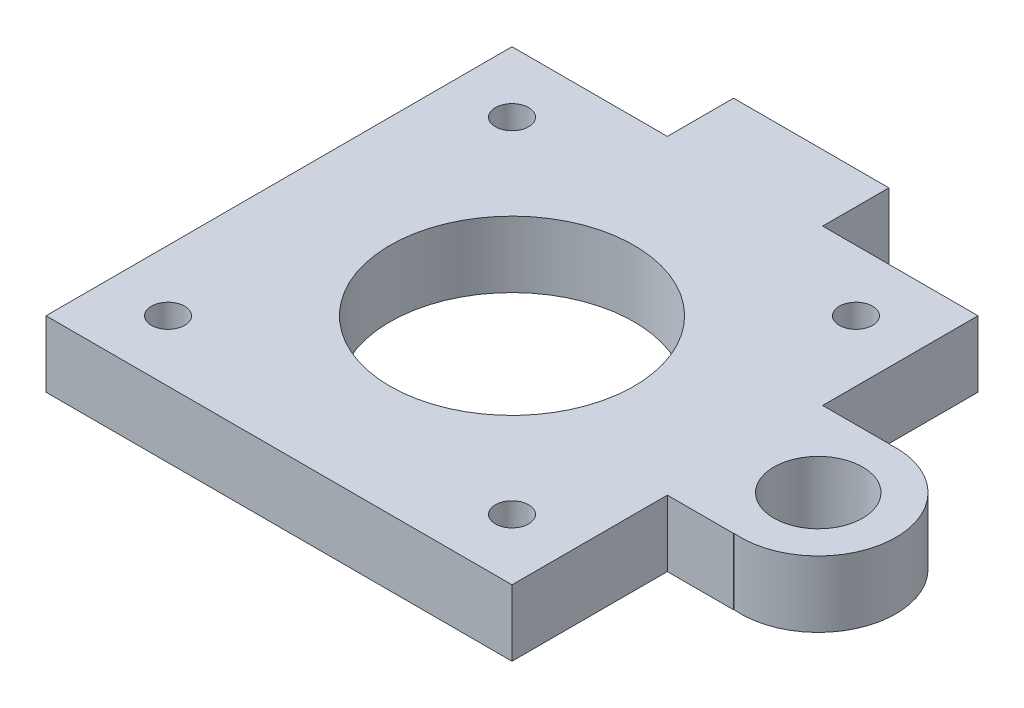
ISO-10303-21;
HEADER;
FILE_DESCRIPTION(('STEP AP214'),'2;1');
FILE_NAME('part.step','',(''),(''),'','','');
FILE_SCHEMA(('AUTOMOTIVE_DESIGN { 1 0 10303 214 1 1 1 1 }'));
ENDSEC;
DATA;
#1=APPLICATION_CONTEXT('core data for automotive mechanical design processes');
#2=APPLICATION_PROTOCOL_DEFINITION('international standard','automotive_design',2000,#1);
#3=PRODUCT_CONTEXT('',#1,'mechanical');
#4=PRODUCT('Part','Part','',(#3));
#5=PRODUCT_RELATED_PRODUCT_CATEGORY('part','',(#4));
#6=PRODUCT_DEFINITION_FORMATION('','',#4);
#7=PRODUCT_DEFINITION_CONTEXT('part definition',#1,'design');
#8=PRODUCT_DEFINITION('design','',#6,#7);
#9=PRODUCT_DEFINITION_SHAPE('','',#8);
#10=(LENGTH_UNIT() NAMED_UNIT(*) SI_UNIT(.MILLI.,.METRE.));
#11=(NAMED_UNIT(*) PLANE_ANGLE_UNIT() SI_UNIT($,.RADIAN.));
#12=(NAMED_UNIT(*) SI_UNIT($,.STERADIAN.) SOLID_ANGLE_UNIT());
#13=UNCERTAINTY_MEASURE_WITH_UNIT(LENGTH_MEASURE(1.E-05),#10,'distance_accuracy_value','');
#14=(GEOMETRIC_REPRESENTATION_CONTEXT(3) GLOBAL_UNCERTAINTY_ASSIGNED_CONTEXT((#13)) GLOBAL_UNIT_ASSIGNED_CONTEXT((#10,
#11,#12)) REPRESENTATION_CONTEXT('',''));
#15=CARTESIAN_POINT('',(0.,0.,0.));
#16=DIRECTION('',(0.,0.,1.));
#17=DIRECTION('',(1.,0.,0.));
#18=AXIS2_PLACEMENT_3D('',#15,#16,#17);
#19=CARTESIAN_POINT('',(47.969,0.,-28.));
#20=DIRECTION('',(1.,0.,0.));
#21=DIRECTION('',(0.,0.,-1.));
#22=AXIS2_PLACEMENT_3D('',#19,#20,#21);
#23=PLANE('',#22);
#24=DIRECTION('',(0.,1.,0.));
#25=VECTOR('',#24,1.);
#26=CARTESIAN_POINT('',(47.969,0.,-27.971147824426));
#27=LINE('',#26,#25);
#28=CARTESIAN_POINT('',(47.969,0.,-27.971147824426));
#29=VERTEX_POINT('',#28);
#30=CARTESIAN_POINT('',(47.969,5.969,-27.971147824426));
#31=VERTEX_POINT('',#30);
#32=EDGE_CURVE('E11',#29,#31,#27,.T.);
#33=ORIENTED_EDGE('',*,*,#32,.F.);
#34=DIRECTION('',(0.,0.,-1.));
#35=VECTOR('',#34,1.);
#36=CARTESIAN_POINT('',(47.969,0.,-28.));
#37=LINE('',#36,#35);
#38=CARTESIAN_POINT('',(47.969,0.,-28.));
#39=VERTEX_POINT('',#38);
#40=EDGE_CURVE('E307',#29,#39,#37,.T.);
#41=ORIENTED_EDGE('',*,*,#40,.T.);
#42=DIRECTION('',(0.,1.,0.));
#43=VECTOR('',#42,1.);
#44=CARTESIAN_POINT('',(47.969,0.,-28.));
#45=LINE('',#44,#43);
#46=CARTESIAN_POINT('',(47.969,5.969,-28.));
#47=VERTEX_POINT('',#46);
#48=EDGE_CURVE('E164',#39,#47,#45,.T.);
#49=ORIENTED_EDGE('',*,*,#48,.T.);
#50=DIRECTION('',(0.,0.,-1.));
#51=VECTOR('',#50,1.);
#52=CARTESIAN_POINT('',(47.969,5.969,-28.));
#53=LINE('',#52,#51);
#54=EDGE_CURVE('E153',#31,#47,#53,.T.);
#55=ORIENTED_EDGE('',*,*,#54,.F.);
#56=EDGE_LOOP('',(#33,#41,#49,#55));
#57=FACE_BOUND('',#56,.T.);
#58=ADVANCED_FACE('F34',(#57),#23,.T.);
#59=CARTESIAN_POINT('',(42.,5.969,0.));
#60=DIRECTION('',(-1.,0.,0.));
#61=DIRECTION('',(0.,0.,1.));
#62=AXIS2_PLACEMENT_3D('',#59,#60,#61);
#63=PLANE('',#62);
#64=DIRECTION('',(0.,1.,0.));
#65=VECTOR('',#64,1.);
#66=CARTESIAN_POINT('',(42.,0.,-28.));
#67=LINE('',#66,#65);
#68=CARTESIAN_POINT('',(42.,0.,-28.));
#69=VERTEX_POINT('',#68);
#70=CARTESIAN_POINT('',(42.,5.969,-28.));
#71=VERTEX_POINT('',#70);
#72=EDGE_CURVE('E161',#69,#71,#67,.T.);
#73=ORIENTED_EDGE('',*,*,#72,.F.);
#74=DIRECTION('',(0.,0.,-1.));
#75=VECTOR('',#74,1.);
#76=CARTESIAN_POINT('',(42.,0.,0.));
#77=LINE('',#76,#75);
#78=CARTESIAN_POINT('',(42.,0.,-42.));
#79=VERTEX_POINT('',#78);
#80=EDGE_CURVE('E246',#69,#79,#77,.T.);
#81=ORIENTED_EDGE('',*,*,#80,.T.);
#82=DIRECTION('',(0.,-1.,0.));
#83=VECTOR('',#82,1.);
#84=CARTESIAN_POINT('',(42.,5.969,-42.));
#85=LINE('',#84,#83);
#86=CARTESIAN_POINT('',(42.,5.969,-42.));
#87=VERTEX_POINT('',#86);
#88=EDGE_CURVE('E255',#87,#79,#85,.T.);
#89=ORIENTED_EDGE('',*,*,#88,.F.);
#90=DIRECTION('',(0.,0.,-1.));
#91=VECTOR('',#90,1.);
#92=CARTESIAN_POINT('',(42.,5.969,0.));
#93=LINE('',#92,#91);
#94=EDGE_CURVE('E234',#71,#87,#93,.T.);
#95=ORIENTED_EDGE('',*,*,#94,.F.);
#96=EDGE_LOOP('',(#73,#81,#89,#95));
#97=FACE_BOUND('',#96,.T.);
#98=ADVANCED_FACE('F304',(#97),#63,.F.);
#99=CARTESIAN_POINT('',(0.,5.969,-42.));
#100=DIRECTION('',(0.,0.,1.));
#101=DIRECTION('',(1.,0.,0.));
#102=AXIS2_PLACEMENT_3D('',#99,#100,#101);
#103=PLANE('',#102);
#104=DIRECTION('',(0.,1.,0.));
#105=VECTOR('',#104,1.);
#106=CARTESIAN_POINT('',(14.,0.,-42.));
#107=LINE('',#106,#105);
#108=CARTESIAN_POINT('',(14.,0.,-42.));
#109=VERTEX_POINT('',#108);
#110=CARTESIAN_POINT('',(14.,5.969,-42.));
#111=VERTEX_POINT('',#110);
#112=EDGE_CURVE('E189',#109,#111,#107,.T.);
#113=ORIENTED_EDGE('',*,*,#112,.F.);
#114=DIRECTION('',(-1.,0.,0.));
#115=VECTOR('',#114,1.);
#116=CARTESIAN_POINT('',(0.,0.,-42.));
#117=LINE('',#116,#115);
#118=CARTESIAN_POINT('',(0.,0.,-42.));
#119=VERTEX_POINT('',#118);
#120=EDGE_CURVE('E250',#109,#119,#117,.T.);
#121=ORIENTED_EDGE('',*,*,#120,.T.);
#122=DIRECTION('',(0.,-1.,0.));
#123=VECTOR('',#122,1.);
#124=CARTESIAN_POINT('',(0.,5.969,-42.));
#125=LINE('',#124,#123);
#126=CARTESIAN_POINT('',(0.,5.969,-42.));
#127=VERTEX_POINT('',#126);
#128=EDGE_CURVE('E241',#127,#119,#125,.T.);
#129=ORIENTED_EDGE('',*,*,#128,.F.);
#130=DIRECTION('',(-1.,0.,0.));
#131=VECTOR('',#130,1.);
#132=CARTESIAN_POINT('',(0.,5.969,-42.));
#133=LINE('',#132,#131);
#134=EDGE_CURVE('E237',#111,#127,#133,.T.);
#135=ORIENTED_EDGE('',*,*,#134,.F.);
#136=EDGE_LOOP('',(#113,#121,#129,#135));
#137=FACE_BOUND('',#136,.T.);
#138=ADVANCED_FACE('F286',(#137),#103,.F.);
#139=CARTESIAN_POINT('',(0.,5.969,0.));
#140=DIRECTION('',(0.,-1.,0.));
#141=DIRECTION('',(0.,0.,-1.));
#142=AXIS2_PLACEMENT_3D('',#139,#140,#141);
#143=PLANE('',#142);
#144=CARTESIAN_POINT('',(48.6039,5.969,-21.));
#145=DIRECTION('',(0.,1.,0.));
#146=DIRECTION('',(0.,0.,1.));
#147=AXIS2_PLACEMENT_3D('',#144,#145,#146);
#148=CIRCLE('',#147,4.00000000000001);
#149=CARTESIAN_POINT('',(48.6039,5.969,-17.));
#150=VERTEX_POINT('',#149);
#151=EDGE_CURVE('E314',#150,#150,#148,.T.);
#152=ORIENTED_EDGE('',*,*,#151,.F.);
#153=EDGE_LOOP('',(#152));
#154=FACE_BOUND('',#153,.T.);
#155=CARTESIAN_POINT('',(47.969,5.969,-14.));
#156=VERTEX_POINT('',#155);
#157=CARTESIAN_POINT('',(47.969,5.969,-14.028852175574));
#158=VERTEX_POINT('',#157);
#159=EDGE_CURVE('E144',#156,#158,#53,.T.);
#160=ORIENTED_EDGE('',*,*,#159,.T.);
#161=CARTESIAN_POINT('',(48.6039,5.969,-21.));
#162=DIRECTION('',(0.,1.,0.));
#163=DIRECTION('',(0.,0.,1.));
#164=AXIS2_PLACEMENT_3D('',#161,#162,#163);
#165=CIRCLE('',#164,7.);
#166=EDGE_CURVE('E50',#158,#31,#165,.T.);
#167=ORIENTED_EDGE('',*,*,#166,.T.);
#168=ORIENTED_EDGE('',*,*,#54,.T.);
#169=DIRECTION('',(-1.,0.,0.));
#170=VECTOR('',#169,1.);
#171=CARTESIAN_POINT('',(42.,5.969,-28.));
#172=LINE('',#171,#170);
#173=EDGE_CURVE('E152',#47,#71,#172,.T.);
#174=ORIENTED_EDGE('',*,*,#173,.T.);
#175=ORIENTED_EDGE('',*,*,#94,.T.);
#176=CARTESIAN_POINT('',(28.,5.969,-42.));
#177=VERTEX_POINT('',#176);
#178=EDGE_CURVE('E238',#87,#177,#133,.T.);
#179=ORIENTED_EDGE('',*,*,#178,.T.);
#180=DIRECTION('',(0.,0.,-1.));
#181=VECTOR('',#180,1.);
#182=CARTESIAN_POINT('',(28.,5.969,-47.969));
#183=LINE('',#182,#181);
#184=CARTESIAN_POINT('',(28.,5.969,-47.969));
#185=VERTEX_POINT('',#184);
#186=EDGE_CURVE('E163',#177,#185,#183,.T.);
#187=ORIENTED_EDGE('',*,*,#186,.T.);
#188=DIRECTION('',(-1.,0.,0.));
#189=VECTOR('',#188,1.);
#190=CARTESIAN_POINT('',(14.,5.969,-47.969));
#191=LINE('',#190,#189);
#192=CARTESIAN_POINT('',(14.,5.969,-47.969));
#193=VERTEX_POINT('',#192);
#194=EDGE_CURVE('E184',#185,#193,#191,.T.);
#195=ORIENTED_EDGE('',*,*,#194,.T.);
#196=DIRECTION('',(0.,0.,1.));
#197=VECTOR('',#196,1.);
#198=CARTESIAN_POINT('',(14.,5.969,-42.));
#199=LINE('',#198,#197);
#200=EDGE_CURVE('E176',#193,#111,#199,.T.);
#201=ORIENTED_EDGE('',*,*,#200,.T.);
#202=ORIENTED_EDGE('',*,*,#134,.T.);
#203=DIRECTION('',(0.,0.,1.));
#204=VECTOR('',#203,1.);
#205=CARTESIAN_POINT('',(0.,5.969,0.));
#206=LINE('',#205,#204);
#207=CARTESIAN_POINT('',(0.,5.969,0.));
#208=VERTEX_POINT('',#207);
#209=EDGE_CURVE('E228',#127,#208,#206,.T.);
#210=ORIENTED_EDGE('',*,*,#209,.T.);
#211=DIRECTION('',(1.,0.,0.));
#212=VECTOR('',#211,1.);
#213=CARTESIAN_POINT('',(0.,5.969,0.));
#214=LINE('',#213,#212);
#215=CARTESIAN_POINT('',(42.,5.969,0.));
#216=VERTEX_POINT('',#215);
#217=EDGE_CURVE('E231',#208,#216,#214,.T.);
#218=ORIENTED_EDGE('',*,*,#217,.T.);
#219=CARTESIAN_POINT('',(42.,5.969,-14.));
#220=VERTEX_POINT('',#219);
#221=EDGE_CURVE('E235',#216,#220,#93,.T.);
#222=ORIENTED_EDGE('',*,*,#221,.T.);
#223=DIRECTION('',(1.,0.,0.));
#224=VECTOR('',#223,1.);
#225=CARTESIAN_POINT('',(42.,5.969,-14.));
#226=LINE('',#225,#224);
#227=EDGE_CURVE('E57',#220,#156,#226,.T.);
#228=ORIENTED_EDGE('',*,*,#227,.T.);
#229=EDGE_LOOP('',(#160,#167,#168,#174,#175,#179,#187,#195,#201,#202,#210,#218,#222,#228));
#230=FACE_BOUND('',#229,.T.);
#231=CARTESIAN_POINT('',(21.,5.969,-21.));
#232=DIRECTION('',(0.,1.,0.));
#233=DIRECTION('',(0.,0.,1.));
#234=AXIS2_PLACEMENT_3D('',#231,#232,#233);
#235=CIRCLE('',#234,11.);
#236=CARTESIAN_POINT('',(21.,5.969,-9.99999999999999));
#237=VERTEX_POINT('',#236);
#238=EDGE_CURVE('E222',#237,#237,#235,.T.);
#239=ORIENTED_EDGE('',*,*,#238,.F.);
#240=EDGE_LOOP('',(#239));
#241=FACE_BOUND('',#240,.T.);
#242=CARTESIAN_POINT('',(5.5,5.969,-36.5));
#243=DIRECTION('',(0.,1.,0.));
#244=DIRECTION('',(0.,0.,1.));
#245=AXIS2_PLACEMENT_3D('',#242,#243,#244);
#246=CIRCLE('',#245,1.5);
#247=CARTESIAN_POINT('',(5.5,5.969,-35.));
#248=VERTEX_POINT('',#247);
#249=EDGE_CURVE('E216',#248,#248,#246,.T.);
#250=ORIENTED_EDGE('',*,*,#249,.F.);
#251=EDGE_LOOP('',(#250));
#252=FACE_BOUND('',#251,.T.);
#253=CARTESIAN_POINT('',(36.5,5.969,-36.5));
#254=DIRECTION('',(0.,1.,0.));
#255=DIRECTION('',(0.,0.,1.));
#256=AXIS2_PLACEMENT_3D('',#253,#254,#255);
#257=CIRCLE('',#256,1.5);
#258=CARTESIAN_POINT('',(36.5,5.969,-35.));
#259=VERTEX_POINT('',#258);
#260=EDGE_CURVE('E210',#259,#259,#257,.T.);
#261=ORIENTED_EDGE('',*,*,#260,.F.);
#262=EDGE_LOOP('',(#261));
#263=FACE_BOUND('',#262,.T.);
#264=CARTESIAN_POINT('',(36.5,5.969,-5.5));
#265=DIRECTION('',(0.,1.,0.));
#266=DIRECTION('',(0.,0.,1.));
#267=AXIS2_PLACEMENT_3D('',#264,#265,#266);
#268=CIRCLE('',#267,1.5);
#269=CARTESIAN_POINT('',(36.5,5.969,-4.));
#270=VERTEX_POINT('',#269);
#271=EDGE_CURVE('E204',#270,#270,#268,.T.);
#272=ORIENTED_EDGE('',*,*,#271,.F.);
#273=EDGE_LOOP('',(#272));
#274=FACE_BOUND('',#273,.T.);
#275=CARTESIAN_POINT('',(5.5,5.969,-5.5));
#276=DIRECTION('',(0.,1.,0.));
#277=DIRECTION('',(0.,0.,1.));
#278=AXIS2_PLACEMENT_3D('',#275,#276,#277);
#279=CIRCLE('',#278,1.5);
#280=CARTESIAN_POINT('',(5.5,5.969,-4.));
#281=VERTEX_POINT('',#280);
#282=EDGE_CURVE('E198',#281,#281,#279,.T.);
#283=ORIENTED_EDGE('',*,*,#282,.F.);
#284=EDGE_LOOP('',(#283));
#285=FACE_BOUND('',#284,.T.);
#286=ADVANCED_FACE('F149',(#154,#230,#241,#252,#263,#274,#285),#143,.F.);
#287=CARTESIAN_POINT('',(0.,0.,0.));
#288=DIRECTION('',(0.,-1.,0.));
#289=DIRECTION('',(0.,0.,-1.));
#290=AXIS2_PLACEMENT_3D('',#287,#288,#289);
#291=PLANE('',#290);
#292=CARTESIAN_POINT('',(48.6039,0.,-21.));
#293=DIRECTION('',(0.,-1.,0.));
#294=DIRECTION('',(0.,0.,-1.));
#295=AXIS2_PLACEMENT_3D('',#292,#293,#294);
#296=CIRCLE('',#295,4.00000000000001);
#297=CARTESIAN_POINT('',(48.6039,0.,-25.));
#298=VERTEX_POINT('',#297);
#299=EDGE_CURVE('E38',#298,#298,#296,.T.);
#300=ORIENTED_EDGE('',*,*,#299,.F.);
#301=EDGE_LOOP('',(#300));
#302=FACE_BOUND('',#301,.T.);
#303=ORIENTED_EDGE('',*,*,#40,.F.);
#304=CARTESIAN_POINT('',(48.6039,0.,-21.));
#305=DIRECTION('',(0.,1.,0.));
#306=DIRECTION('',(0.,0.,1.));
#307=AXIS2_PLACEMENT_3D('',#304,#305,#306);
#308=CIRCLE('',#307,7.);
#309=CARTESIAN_POINT('',(47.969,0.,-14.028852175574));
#310=VERTEX_POINT('',#309);
#311=EDGE_CURVE('E138',#310,#29,#308,.T.);
#312=ORIENTED_EDGE('',*,*,#311,.F.);
#313=CARTESIAN_POINT('',(47.969,0.,-14.));
#314=VERTEX_POINT('',#313);
#315=EDGE_CURVE('E146',#314,#310,#37,.T.);
#316=ORIENTED_EDGE('',*,*,#315,.F.);
#317=DIRECTION('',(1.,0.,0.));
#318=VECTOR('',#317,1.);
#319=CARTESIAN_POINT('',(42.,0.,-14.));
#320=LINE('',#319,#318);
#321=CARTESIAN_POINT('',(42.,0.,-14.));
#322=VERTEX_POINT('',#321);
#323=EDGE_CURVE('E156',#322,#314,#320,.T.);
#324=ORIENTED_EDGE('',*,*,#323,.F.);
#325=CARTESIAN_POINT('',(42.,0.,0.));
#326=VERTEX_POINT('',#325);
#327=EDGE_CURVE('E247',#326,#322,#77,.T.);
#328=ORIENTED_EDGE('',*,*,#327,.F.);
#329=DIRECTION('',(1.,0.,0.));
#330=VECTOR('',#329,1.);
#331=CARTESIAN_POINT('',(0.,0.,0.));
#332=LINE('',#331,#330);
#333=CARTESIAN_POINT('',(0.,0.,0.));
#334=VERTEX_POINT('',#333);
#335=EDGE_CURVE('E244',#334,#326,#332,.T.);
#336=ORIENTED_EDGE('',*,*,#335,.F.);
#337=DIRECTION('',(0.,0.,1.));
#338=VECTOR('',#337,1.);
#339=CARTESIAN_POINT('',(0.,0.,0.));
#340=LINE('',#339,#338);
#341=EDGE_CURVE('E225',#119,#334,#340,.T.);
#342=ORIENTED_EDGE('',*,*,#341,.F.);
#343=ORIENTED_EDGE('',*,*,#120,.F.);
#344=DIRECTION('',(0.,0.,1.));
#345=VECTOR('',#344,1.);
#346=CARTESIAN_POINT('',(14.,0.,-42.));
#347=LINE('',#346,#345);
#348=CARTESIAN_POINT('',(14.,0.,-47.969));
#349=VERTEX_POINT('',#348);
#350=EDGE_CURVE('E179',#349,#109,#347,.T.);
#351=ORIENTED_EDGE('',*,*,#350,.F.);
#352=DIRECTION('',(-1.,0.,0.));
#353=VECTOR('',#352,1.);
#354=CARTESIAN_POINT('',(14.,0.,-47.969));
#355=LINE('',#354,#353);
#356=CARTESIAN_POINT('',(28.,0.,-47.969));
#357=VERTEX_POINT('',#356);
#358=EDGE_CURVE('E175',#357,#349,#355,.T.);
#359=ORIENTED_EDGE('',*,*,#358,.F.);
#360=DIRECTION('',(0.,0.,-1.));
#361=VECTOR('',#360,1.);
#362=CARTESIAN_POINT('',(28.,0.,-47.969));
#363=LINE('',#362,#361);
#364=CARTESIAN_POINT('',(28.,0.,-42.));
#365=VERTEX_POINT('',#364);
#366=EDGE_CURVE('E172',#365,#357,#363,.T.);
#367=ORIENTED_EDGE('',*,*,#366,.F.);
#368=EDGE_CURVE('E232',#79,#365,#117,.T.);
#369=ORIENTED_EDGE('',*,*,#368,.F.);
#370=ORIENTED_EDGE('',*,*,#80,.F.);
#371=DIRECTION('',(-1.,0.,0.));
#372=VECTOR('',#371,1.);
#373=CARTESIAN_POINT('',(42.,0.,-28.));
#374=LINE('',#373,#372);
#375=EDGE_CURVE('E171',#39,#69,#374,.T.);
#376=ORIENTED_EDGE('',*,*,#375,.F.);
#377=EDGE_LOOP('',(#303,#312,#316,#324,#328,#336,#342,#343,#351,#359,#367,#369,#370,#376));
#378=FACE_BOUND('',#377,.T.);
#379=CARTESIAN_POINT('',(36.5,0.,-5.5));
#380=DIRECTION('',(0.,1.,0.));
#381=DIRECTION('',(0.,0.,1.));
#382=AXIS2_PLACEMENT_3D('',#379,#380,#381);
#383=CIRCLE('',#382,1.5);
#384=CARTESIAN_POINT('',(36.5,0.,-4.));
#385=VERTEX_POINT('',#384);
#386=EDGE_CURVE('E201',#385,#385,#383,.T.);
#387=ORIENTED_EDGE('',*,*,#386,.T.);
#388=EDGE_LOOP('',(#387));
#389=FACE_BOUND('',#388,.T.);
#390=CARTESIAN_POINT('',(5.5,0.,-36.5));
#391=DIRECTION('',(0.,1.,0.));
#392=DIRECTION('',(0.,0.,1.));
#393=AXIS2_PLACEMENT_3D('',#390,#391,#392);
#394=CIRCLE('',#393,1.5);
#395=CARTESIAN_POINT('',(5.5,0.,-35.));
#396=VERTEX_POINT('',#395);
#397=EDGE_CURVE('E213',#396,#396,#394,.T.);
#398=ORIENTED_EDGE('',*,*,#397,.T.);
#399=EDGE_LOOP('',(#398));
#400=FACE_BOUND('',#399,.T.);
#401=CARTESIAN_POINT('',(21.,0.,-21.));
#402=DIRECTION('',(0.,1.,0.));
#403=DIRECTION('',(0.,0.,1.));
#404=AXIS2_PLACEMENT_3D('',#401,#402,#403);
#405=CIRCLE('',#404,11.);
#406=CARTESIAN_POINT('',(21.,0.,-9.99999999999999));
#407=VERTEX_POINT('',#406);
#408=EDGE_CURVE('E219',#407,#407,#405,.T.);
#409=ORIENTED_EDGE('',*,*,#408,.T.);
#410=EDGE_LOOP('',(#409));
#411=FACE_BOUND('',#410,.T.);
#412=CARTESIAN_POINT('',(36.5,0.,-36.5));
#413=DIRECTION('',(0.,1.,0.));
#414=DIRECTION('',(0.,0.,1.));
#415=AXIS2_PLACEMENT_3D('',#412,#413,#414);
#416=CIRCLE('',#415,1.5);
#417=CARTESIAN_POINT('',(36.5,0.,-35.));
#418=VERTEX_POINT('',#417);
#419=EDGE_CURVE('E207',#418,#418,#416,.T.);
#420=ORIENTED_EDGE('',*,*,#419,.T.);
#421=EDGE_LOOP('',(#420));
#422=FACE_BOUND('',#421,.T.);
#423=CARTESIAN_POINT('',(5.5,0.,-5.5));
#424=DIRECTION('',(0.,1.,0.));
#425=DIRECTION('',(0.,0.,1.));
#426=AXIS2_PLACEMENT_3D('',#423,#424,#425);
#427=CIRCLE('',#426,1.5);
#428=CARTESIAN_POINT('',(5.5,0.,-4.));
#429=VERTEX_POINT('',#428);
#430=EDGE_CURVE('E191',#429,#429,#427,.T.);
#431=ORIENTED_EDGE('',*,*,#430,.T.);
#432=EDGE_LOOP('',(#431));
#433=FACE_BOUND('',#432,.T.);
#434=ADVANCED_FACE('F273',(#302,#378,#389,#400,#411,#422,#433),#291,.T.);
#435=CARTESIAN_POINT('',(0.,5.969,0.));
#436=DIRECTION('',(1.,0.,0.));
#437=DIRECTION('',(0.,0.,-1.));
#438=AXIS2_PLACEMENT_3D('',#435,#436,#437);
#439=PLANE('',#438);
#440=ORIENTED_EDGE('',*,*,#341,.T.);
#441=DIRECTION('',(0.,-1.,0.));
#442=VECTOR('',#441,1.);
#443=CARTESIAN_POINT('',(0.,5.969,0.));
#444=LINE('',#443,#442);
#445=EDGE_CURVE('E147',#208,#334,#444,.T.);
#446=ORIENTED_EDGE('',*,*,#445,.F.);
#447=ORIENTED_EDGE('',*,*,#209,.F.);
#448=ORIENTED_EDGE('',*,*,#128,.T.);
#449=EDGE_LOOP('',(#440,#446,#447,#448));
#450=FACE_BOUND('',#449,.T.);
#451=ADVANCED_FACE('F36',(#450),#439,.F.);
#452=CARTESIAN_POINT('',(0.,5.969,0.));
#453=DIRECTION('',(0.,0.,-1.));
#454=DIRECTION('',(-1.,0.,0.));
#455=AXIS2_PLACEMENT_3D('',#452,#453,#454);
#456=PLANE('',#455);
#457=ORIENTED_EDGE('',*,*,#335,.T.);
#458=DIRECTION('',(0.,-1.,0.));
#459=VECTOR('',#458,1.);
#460=CARTESIAN_POINT('',(42.,5.969,0.));
#461=LINE('',#460,#459);
#462=EDGE_CURVE('E258',#216,#326,#461,.T.);
#463=ORIENTED_EDGE('',*,*,#462,.F.);
#464=ORIENTED_EDGE('',*,*,#217,.F.);
#465=ORIENTED_EDGE('',*,*,#445,.T.);
#466=EDGE_LOOP('',(#457,#463,#464,#465));
#467=FACE_BOUND('',#466,.T.);
#468=ADVANCED_FACE('F264',(#467),#456,.F.);
#469=ORIENTED_EDGE('',*,*,#327,.T.);
#470=DIRECTION('',(0.,1.,0.));
#471=VECTOR('',#470,1.);
#472=CARTESIAN_POINT('',(42.,0.,-14.));
#473=LINE('',#472,#471);
#474=EDGE_CURVE('E169',#322,#220,#473,.T.);
#475=ORIENTED_EDGE('',*,*,#474,.T.);
#476=ORIENTED_EDGE('',*,*,#221,.F.);
#477=ORIENTED_EDGE('',*,*,#462,.T.);
#478=EDGE_LOOP('',(#469,#475,#476,#477));
#479=FACE_BOUND('',#478,.T.);
#480=ADVANCED_FACE('F280',(#479),#63,.F.);
#481=ORIENTED_EDGE('',*,*,#368,.T.);
#482=DIRECTION('',(0.,1.,0.));
#483=VECTOR('',#482,1.);
#484=CARTESIAN_POINT('',(28.,0.,-42.));
#485=LINE('',#484,#483);
#486=EDGE_CURVE('E181',#365,#177,#485,.T.);
#487=ORIENTED_EDGE('',*,*,#486,.T.);
#488=ORIENTED_EDGE('',*,*,#178,.F.);
#489=ORIENTED_EDGE('',*,*,#88,.T.);
#490=EDGE_LOOP('',(#481,#487,#488,#489));
#491=FACE_BOUND('',#490,.T.);
#492=ADVANCED_FACE('F298',(#491),#103,.F.);
#493=CARTESIAN_POINT('',(21.,5.969,-21.));
#494=DIRECTION('',(0.,-1.,0.));
#495=DIRECTION('',(0.,0.,-1.));
#496=AXIS2_PLACEMENT_3D('',#493,#494,#495);
#497=CYLINDRICAL_SURFACE('',#496,11.);
#498=ORIENTED_EDGE('',*,*,#238,.T.);
#499=EDGE_LOOP('',(#498));
#500=FACE_BOUND('',#499,.T.);
#501=ORIENTED_EDGE('',*,*,#408,.F.);
#502=EDGE_LOOP('',(#501));
#503=FACE_BOUND('',#502,.T.);
#504=ADVANCED_FACE('F480',(#500,#503),#497,.F.);
#505=CARTESIAN_POINT('',(5.5,5.969,-36.5));
#506=DIRECTION('',(0.,-1.,0.));
#507=DIRECTION('',(0.,0.,-1.));
#508=AXIS2_PLACEMENT_3D('',#505,#506,#507);
#509=CYLINDRICAL_SURFACE('',#508,1.5);
#510=ORIENTED_EDGE('',*,*,#249,.T.);
#511=EDGE_LOOP('',(#510));
#512=FACE_BOUND('',#511,.T.);
#513=ORIENTED_EDGE('',*,*,#397,.F.);
#514=EDGE_LOOP('',(#513));
#515=FACE_BOUND('',#514,.T.);
#516=ADVANCED_FACE('F470',(#512,#515),#509,.F.);
#517=CARTESIAN_POINT('',(36.5,5.969,-36.5));
#518=DIRECTION('',(0.,-1.,0.));
#519=DIRECTION('',(0.,0.,-1.));
#520=AXIS2_PLACEMENT_3D('',#517,#518,#519);
#521=CYLINDRICAL_SURFACE('',#520,1.5);
#522=ORIENTED_EDGE('',*,*,#260,.T.);
#523=EDGE_LOOP('',(#522));
#524=FACE_BOUND('',#523,.T.);
#525=ORIENTED_EDGE('',*,*,#419,.F.);
#526=EDGE_LOOP('',(#525));
#527=FACE_BOUND('',#526,.T.);
#528=ADVANCED_FACE('F460',(#524,#527),#521,.F.);
#529=CARTESIAN_POINT('',(36.5,5.969,-5.5));
#530=DIRECTION('',(0.,-1.,0.));
#531=DIRECTION('',(0.,0.,-1.));
#532=AXIS2_PLACEMENT_3D('',#529,#530,#531);
#533=CYLINDRICAL_SURFACE('',#532,1.5);
#534=ORIENTED_EDGE('',*,*,#271,.T.);
#535=EDGE_LOOP('',(#534));
#536=FACE_BOUND('',#535,.T.);
#537=ORIENTED_EDGE('',*,*,#386,.F.);
#538=EDGE_LOOP('',(#537));
#539=FACE_BOUND('',#538,.T.);
#540=ADVANCED_FACE('F450',(#536,#539),#533,.F.);
#541=CARTESIAN_POINT('',(5.5,5.969,-5.5));
#542=DIRECTION('',(0.,-1.,0.));
#543=DIRECTION('',(0.,0.,-1.));
#544=AXIS2_PLACEMENT_3D('',#541,#542,#543);
#545=CYLINDRICAL_SURFACE('',#544,1.5);
#546=ORIENTED_EDGE('',*,*,#282,.T.);
#547=EDGE_LOOP('',(#546));
#548=FACE_BOUND('',#547,.T.);
#549=ORIENTED_EDGE('',*,*,#430,.F.);
#550=EDGE_LOOP('',(#549));
#551=FACE_BOUND('',#550,.T.);
#552=ADVANCED_FACE('F404',(#548,#551),#545,.F.);
#553=CARTESIAN_POINT('',(14.,0.,-42.));
#554=DIRECTION('',(-1.,0.,0.));
#555=DIRECTION('',(0.,0.,1.));
#556=AXIS2_PLACEMENT_3D('',#553,#554,#555);
#557=PLANE('',#556);
#558=ORIENTED_EDGE('',*,*,#200,.F.);
#559=DIRECTION('',(0.,1.,0.));
#560=VECTOR('',#559,1.);
#561=CARTESIAN_POINT('',(14.,0.,-47.969));
#562=LINE('',#561,#560);
#563=EDGE_CURVE('E192',#349,#193,#562,.T.);
#564=ORIENTED_EDGE('',*,*,#563,.F.);
#565=ORIENTED_EDGE('',*,*,#350,.T.);
#566=ORIENTED_EDGE('',*,*,#112,.T.);
#567=EDGE_LOOP('',(#558,#564,#565,#566));
#568=FACE_BOUND('',#567,.T.);
#569=ADVANCED_FACE('F288',(#568),#557,.T.);
#570=CARTESIAN_POINT('',(14.,0.,-47.969));
#571=DIRECTION('',(0.,0.,-1.));
#572=DIRECTION('',(-1.,0.,0.));
#573=AXIS2_PLACEMENT_3D('',#570,#571,#572);
#574=PLANE('',#573);
#575=ORIENTED_EDGE('',*,*,#194,.F.);
#576=DIRECTION('',(0.,1.,0.));
#577=VECTOR('',#576,1.);
#578=CARTESIAN_POINT('',(28.,0.,-47.969));
#579=LINE('',#578,#577);
#580=EDGE_CURVE('E194',#357,#185,#579,.T.);
#581=ORIENTED_EDGE('',*,*,#580,.F.);
#582=ORIENTED_EDGE('',*,*,#358,.T.);
#583=ORIENTED_EDGE('',*,*,#563,.T.);
#584=EDGE_LOOP('',(#575,#581,#582,#583));
#585=FACE_BOUND('',#584,.T.);
#586=ADVANCED_FACE('F351',(#585),#574,.T.);
#587=CARTESIAN_POINT('',(28.,0.,-47.969));
#588=DIRECTION('',(1.,0.,0.));
#589=DIRECTION('',(0.,0.,-1.));
#590=AXIS2_PLACEMENT_3D('',#587,#588,#589);
#591=PLANE('',#590);
#592=ORIENTED_EDGE('',*,*,#186,.F.);
#593=ORIENTED_EDGE('',*,*,#486,.F.);
#594=ORIENTED_EDGE('',*,*,#366,.T.);
#595=ORIENTED_EDGE('',*,*,#580,.T.);
#596=EDGE_LOOP('',(#592,#593,#594,#595));
#597=FACE_BOUND('',#596,.T.);
#598=ADVANCED_FACE('F294',(#597),#591,.T.);
#599=CARTESIAN_POINT('',(42.,0.,-28.));
#600=DIRECTION('',(0.,0.,-1.));
#601=DIRECTION('',(-1.,0.,0.));
#602=AXIS2_PLACEMENT_3D('',#599,#600,#601);
#603=PLANE('',#602);
#604=ORIENTED_EDGE('',*,*,#173,.F.);
#605=ORIENTED_EDGE('',*,*,#48,.F.);
#606=ORIENTED_EDGE('',*,*,#375,.T.);
#607=ORIENTED_EDGE('',*,*,#72,.T.);
#608=EDGE_LOOP('',(#604,#605,#606,#607));
#609=FACE_BOUND('',#608,.T.);
#610=ADVANCED_FACE('F343',(#609),#603,.T.);
#611=DIRECTION('',(0.,1.,0.));
#612=VECTOR('',#611,1.);
#613=CARTESIAN_POINT('',(47.969,0.,-14.028852175574));
#614=LINE('',#613,#612);
#615=EDGE_CURVE('E43',#158,#310,#614,.F.);
#616=ORIENTED_EDGE('',*,*,#615,.F.);
#617=ORIENTED_EDGE('',*,*,#159,.F.);
#618=DIRECTION('',(0.,1.,0.));
#619=VECTOR('',#618,1.);
#620=CARTESIAN_POINT('',(47.969,0.,-14.));
#621=LINE('',#620,#619);
#622=EDGE_CURVE('E167',#314,#156,#621,.T.);
#623=ORIENTED_EDGE('',*,*,#622,.F.);
#624=ORIENTED_EDGE('',*,*,#315,.T.);
#625=EDGE_LOOP('',(#616,#617,#623,#624));
#626=FACE_BOUND('',#625,.T.);
#627=ADVANCED_FACE('F143',(#626),#23,.T.);
#628=CARTESIAN_POINT('',(42.,0.,-14.));
#629=DIRECTION('',(0.,0.,1.));
#630=DIRECTION('',(1.,0.,0.));
#631=AXIS2_PLACEMENT_3D('',#628,#629,#630);
#632=PLANE('',#631);
#633=ORIENTED_EDGE('',*,*,#227,.F.);
#634=ORIENTED_EDGE('',*,*,#474,.F.);
#635=ORIENTED_EDGE('',*,*,#323,.T.);
#636=ORIENTED_EDGE('',*,*,#622,.T.);
#637=EDGE_LOOP('',(#633,#634,#635,#636));
#638=FACE_BOUND('',#637,.T.);
#639=ADVANCED_FACE('F342',(#638),#632,.T.);
#640=CARTESIAN_POINT('',(48.6039,0.,-21.));
#641=DIRECTION('',(0.,1.,0.));
#642=DIRECTION('',(0.,0.,1.));
#643=AXIS2_PLACEMENT_3D('',#640,#641,#642);
#644=CYLINDRICAL_SURFACE('',#643,7.);
#645=ORIENTED_EDGE('',*,*,#311,.T.);
#646=ORIENTED_EDGE('',*,*,#32,.T.);
#647=ORIENTED_EDGE('',*,*,#166,.F.);
#648=ORIENTED_EDGE('',*,*,#615,.T.);
#649=EDGE_LOOP('',(#645,#646,#647,#648));
#650=FACE_BOUND('',#649,.T.);
#651=ADVANCED_FACE('F134',(#650),#644,.T.);
#652=CARTESIAN_POINT('',(48.6039,-0.381,-21.));
#653=DIRECTION('',(0.,1.,0.));
#654=DIRECTION('',(0.,0.,1.));
#655=AXIS2_PLACEMENT_3D('',#652,#653,#654);
#656=CYLINDRICAL_SURFACE('',#655,4.00000000000001);
#657=ORIENTED_EDGE('',*,*,#299,.T.);
#658=EDGE_LOOP('',(#657));
#659=FACE_BOUND('',#658,.T.);
#660=ORIENTED_EDGE('',*,*,#151,.T.);
#661=EDGE_LOOP('',(#660));
#662=FACE_BOUND('',#661,.T.);
#663=ADVANCED_FACE('F321',(#659,#662),#656,.F.);
#664=CLOSED_SHELL('',(#58,#98,#138,#286,#434,#451,#468,#480,#492,#504,#516,#528,#540,#552,#569,
#586,#598,#610,#627,#639,#651,#663));
#665=MANIFOLD_SOLID_BREP('B2',#664);
#666=ADVANCED_BREP_SHAPE_REPRESENTATION('',(#18,#665),#14);
#667=SHAPE_DEFINITION_REPRESENTATION(#9,#666);
ENDSEC;
END-ISO-10303-21;
